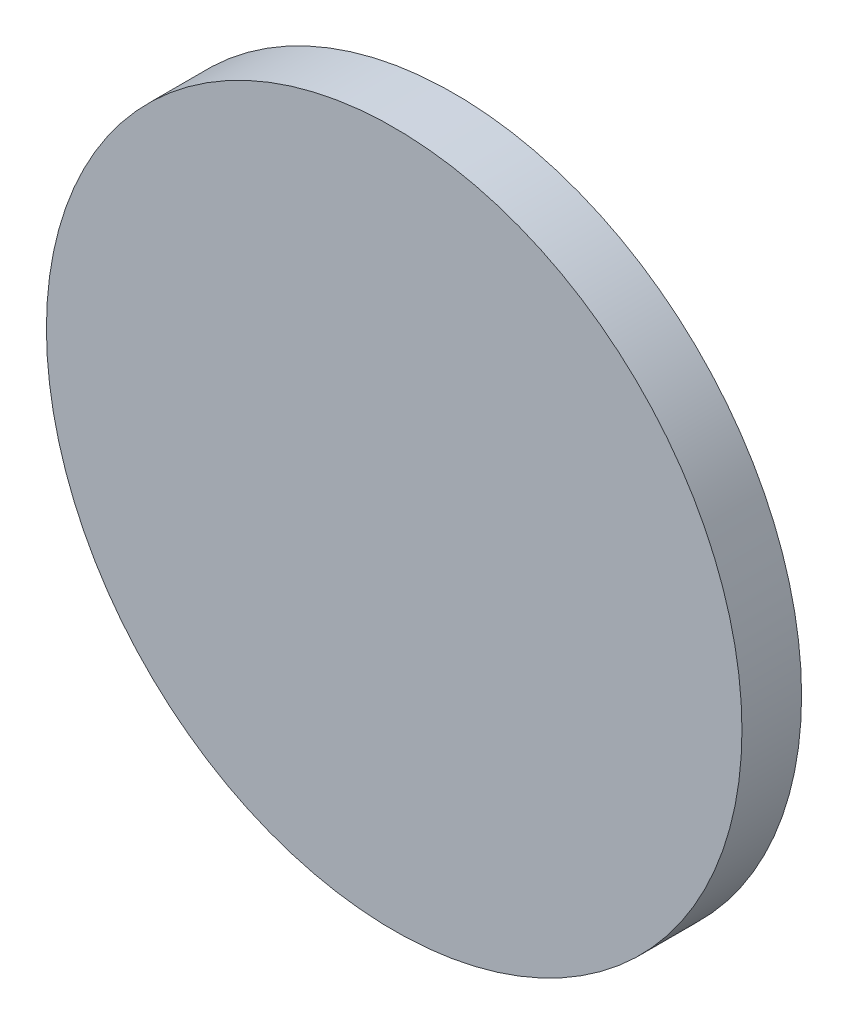
ISO-10303-21;
HEADER;
FILE_DESCRIPTION(('STEP AP214'),'2;1');
FILE_NAME('part.step','',(''),(''),'','','');
FILE_SCHEMA(('AUTOMOTIVE_DESIGN { 1 0 10303 214 1 1 1 1 }'));
ENDSEC;
DATA;
#1=APPLICATION_CONTEXT('core data for automotive mechanical design processes');
#2=APPLICATION_PROTOCOL_DEFINITION('international standard','automotive_design',2000,#1);
#3=PRODUCT_CONTEXT('',#1,'mechanical');
#4=PRODUCT('Part','Part','',(#3));
#5=PRODUCT_RELATED_PRODUCT_CATEGORY('part','',(#4));
#6=PRODUCT_DEFINITION_FORMATION('','',#4);
#7=PRODUCT_DEFINITION_CONTEXT('part definition',#1,'design');
#8=PRODUCT_DEFINITION('design','',#6,#7);
#9=PRODUCT_DEFINITION_SHAPE('','',#8);
#10=(LENGTH_UNIT() NAMED_UNIT(*) SI_UNIT(.MILLI.,.METRE.));
#11=(NAMED_UNIT(*) PLANE_ANGLE_UNIT() SI_UNIT($,.RADIAN.));
#12=(NAMED_UNIT(*) SI_UNIT($,.STERADIAN.) SOLID_ANGLE_UNIT());
#13=UNCERTAINTY_MEASURE_WITH_UNIT(LENGTH_MEASURE(1.E-05),#10,'distance_accuracy_value','');
#14=(GEOMETRIC_REPRESENTATION_CONTEXT(3) GLOBAL_UNCERTAINTY_ASSIGNED_CONTEXT((#13)) GLOBAL_UNIT_ASSIGNED_CONTEXT((#10,
#11,#12)) REPRESENTATION_CONTEXT('',''));
#15=CARTESIAN_POINT('',(0.,0.,0.));
#16=DIRECTION('',(0.,0.,1.));
#17=DIRECTION('',(1.,0.,0.));
#18=AXIS2_PLACEMENT_3D('',#15,#16,#17);
#19=CARTESIAN_POINT('',(2.413,6.794500006176,0.));
#20=DIRECTION('',(0.,0.,-1.));
#21=DIRECTION('',(-1.,0.,0.));
#22=AXIS2_PLACEMENT_3D('',#19,#20,#21);
#23=PLANE('',#22);
#24=CARTESIAN_POINT('',(2.413,6.794500006176,0.));
#25=DIRECTION('',(0.,0.,1.));
#26=DIRECTION('',(1.,0.,0.));
#27=AXIS2_PLACEMENT_3D('',#24,#25,#26);
#28=CIRCLE('',#27,0.200024667);
#29=CARTESIAN_POINT('',(2.613024667,6.794500006176,0.));
#30=VERTEX_POINT('',#29);
#31=EDGE_CURVE('E18',#30,#30,#28,.T.);
#32=ORIENTED_EDGE('',*,*,#31,.F.);
#33=EDGE_LOOP('',(#32));
#34=FACE_BOUND('',#33,.T.);
#35=ADVANCED_FACE('F15',(#34),#23,.T.);
#36=CARTESIAN_POINT('',(2.413,6.794500006176,0.));
#37=DIRECTION('',(0.,0.,1.));
#38=DIRECTION('',(1.,0.,0.));
#39=AXIS2_PLACEMENT_3D('',#36,#37,#38);
#40=CYLINDRICAL_SURFACE('',#39,0.200024667);
#41=CARTESIAN_POINT('',(2.413,6.794500006176,0.03429));
#42=DIRECTION('',(0.,0.,1.));
#43=DIRECTION('',(1.,0.,0.));
#44=AXIS2_PLACEMENT_3D('',#41,#42,#43);
#45=CIRCLE('',#44,0.200024667);
#46=CARTESIAN_POINT('',(2.613024667,6.794500006176,0.03429));
#47=VERTEX_POINT('',#46);
#48=EDGE_CURVE('E10',#47,#47,#45,.T.);
#49=ORIENTED_EDGE('',*,*,#48,.F.);
#50=EDGE_LOOP('',(#49));
#51=FACE_BOUND('',#50,.T.);
#52=ORIENTED_EDGE('',*,*,#31,.T.);
#53=EDGE_LOOP('',(#52));
#54=FACE_BOUND('',#53,.T.);
#55=ADVANCED_FACE('F27',(#51,#54),#40,.T.);
#56=CARTESIAN_POINT('',(2.413,6.794500006176,0.03429));
#57=DIRECTION('',(0.,0.,1.));
#58=DIRECTION('',(1.,0.,0.));
#59=AXIS2_PLACEMENT_3D('',#56,#57,#58);
#60=PLANE('',#59);
#61=ORIENTED_EDGE('',*,*,#48,.T.);
#62=EDGE_LOOP('',(#61));
#63=FACE_BOUND('',#62,.T.);
#64=ADVANCED_FACE('F34',(#63),#60,.T.);
#65=CLOSED_SHELL('',(#35,#55,#64));
#66=MANIFOLD_SOLID_BREP('B1',#65);
#67=ADVANCED_BREP_SHAPE_REPRESENTATION('',(#18,#66),#14);
#68=SHAPE_DEFINITION_REPRESENTATION(#9,#67);
ENDSEC;
END-ISO-10303-21;
